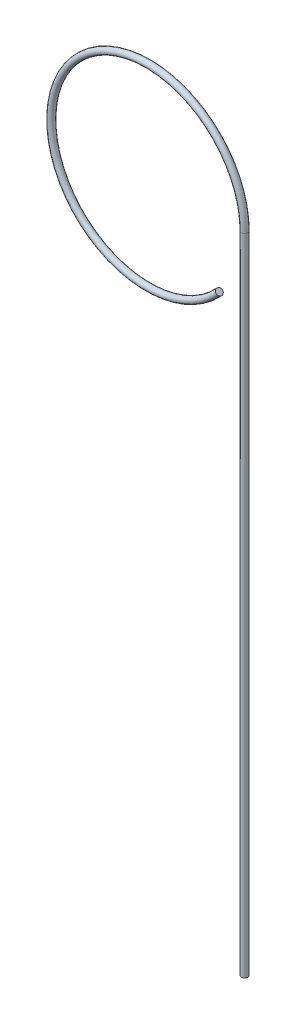
ISO-10303-21;
HEADER;
FILE_DESCRIPTION(('STEP AP214'),'2;1');
FILE_NAME('part.step','',(''),(''),'','','');
FILE_SCHEMA(('AUTOMOTIVE_DESIGN { 1 0 10303 214 1 1 1 1 }'));
ENDSEC;
DATA;
#1=APPLICATION_CONTEXT('core data for automotive mechanical design processes');
#2=APPLICATION_PROTOCOL_DEFINITION('international standard','automotive_design',2000,#1);
#3=PRODUCT_CONTEXT('',#1,'mechanical');
#4=PRODUCT('Part','Part','',(#3));
#5=PRODUCT_RELATED_PRODUCT_CATEGORY('part','',(#4));
#6=PRODUCT_DEFINITION_FORMATION('','',#4);
#7=PRODUCT_DEFINITION_CONTEXT('part definition',#1,'design');
#8=PRODUCT_DEFINITION('design','',#6,#7);
#9=PRODUCT_DEFINITION_SHAPE('','',#8);
#10=(LENGTH_UNIT() NAMED_UNIT(*) SI_UNIT(.MILLI.,.METRE.));
#11=(NAMED_UNIT(*) PLANE_ANGLE_UNIT() SI_UNIT($,.RADIAN.));
#12=(NAMED_UNIT(*) SI_UNIT($,.STERADIAN.) SOLID_ANGLE_UNIT());
#13=UNCERTAINTY_MEASURE_WITH_UNIT(LENGTH_MEASURE(1.E-05),#10,'distance_accuracy_value','');
#14=(GEOMETRIC_REPRESENTATION_CONTEXT(3) GLOBAL_UNCERTAINTY_ASSIGNED_CONTEXT((#13)) GLOBAL_UNIT_ASSIGNED_CONTEXT((#10,
#11,#12)) REPRESENTATION_CONTEXT('',''));
#15=CARTESIAN_POINT('',(0.,0.,0.));
#16=DIRECTION('',(0.,0.,1.));
#17=DIRECTION('',(1.,0.,0.));
#18=AXIS2_PLACEMENT_3D('',#15,#16,#17);
#19=CARTESIAN_POINT('',(22.1333046013693,-20.2513413734252,0.));
#20=DIRECTION('',(0.675044712447505,0.737776820045645,0.));
#21=DIRECTION('',(0.,0.,1.));
#22=AXIS2_PLACEMENT_3D('',#19,#20,#21);
#23=PLANE('',#22);
#24=CARTESIAN_POINT('',(22.1333046013693,-20.2513413734252,0.));
#25=DIRECTION('',(0.675044712447505,0.737776820045645,0.));
#26=DIRECTION('',(0.,0.,1.));
#27=AXIS2_PLACEMENT_3D('',#24,#25,#26);
#28=CIRCLE('',#27,1.);
#29=CARTESIAN_POINT('',(22.871081421415,-20.9263860858727,0.));
#30=VERTEX_POINT('',#29);
#31=EDGE_CURVE('E48',#30,#30,#28,.T.);
#32=ORIENTED_EDGE('',*,*,#31,.T.);
#33=EDGE_LOOP('',(#32));
#34=FACE_BOUND('',#33,.T.);
#35=ADVANCED_FACE('F41',(#34),#23,.T.);
#36=CARTESIAN_POINT('',(0.,0.,0.));
#37=DIRECTION('',(0.,0.,-1.));
#38=DIRECTION('',(-1.,0.,0.));
#39=AXIS2_PLACEMENT_3D('',#36,#37,#38);
#40=TOROIDAL_SURFACE('',#39,30.,1.);
#41=CARTESIAN_POINT('',(30.,0.,0.));
#42=DIRECTION('',(0.,1.,0.));
#43=DIRECTION('',(0.,0.,1.));
#44=AXIS2_PLACEMENT_3D('',#41,#42,#43);
#45=CIRCLE('',#44,1.);
#46=CARTESIAN_POINT('',(31.,0.,0.));
#47=VERTEX_POINT('',#46);
#48=EDGE_CURVE('E10',#47,#47,#45,.T.);
#49=CARTESIAN_POINT('',(0.,0.,0.));
#50=DIRECTION('',(0.,0.,-1.));
#51=DIRECTION('',(-1.,0.,0.));
#52=AXIS2_PLACEMENT_3D('',#49,#50,#51);
#53=CIRCLE('',#52,31.);
#54=EDGE_CURVE('',#30,#47,#53,.T.);
#55=ORIENTED_EDGE('',*,*,#31,.F.);
#56=ORIENTED_EDGE('',*,*,#48,.T.);
#57=ORIENTED_EDGE('',*,*,#54,.T.);
#58=ORIENTED_EDGE('',*,*,#54,.F.);
#59=EDGE_LOOP('',(#55,#57,#56,#58));
#60=FACE_BOUND('',#59,.T.);
#61=ADVANCED_FACE('F65',(#60),#40,.T.);
#62=CARTESIAN_POINT('',(30.,0.,0.));
#63=DIRECTION('',(0.,-1.,0.));
#64=DIRECTION('',(1.,0.,0.));
#65=AXIS2_PLACEMENT_3D('',#62,#63,#64);
#66=CYLINDRICAL_SURFACE('',#65,1.);
#67=ORIENTED_EDGE('',*,*,#48,.F.);
#68=EDGE_LOOP('',(#67));
#69=FACE_BOUND('',#68,.T.);
#70=CARTESIAN_POINT('',(30.,-200.,0.));
#71=DIRECTION('',(0.,-1.,0.));
#72=DIRECTION('',(0.,0.,-1.));
#73=AXIS2_PLACEMENT_3D('',#70,#71,#72);
#74=CIRCLE('',#73,1.);
#75=CARTESIAN_POINT('',(30.,-200.,-1.));
#76=VERTEX_POINT('',#75);
#77=EDGE_CURVE('E53',#76,#76,#74,.T.);
#78=ORIENTED_EDGE('',*,*,#77,.F.);
#79=EDGE_LOOP('',(#78));
#80=FACE_BOUND('',#79,.T.);
#81=ADVANCED_FACE('F63',(#69,#80),#66,.T.);
#82=CARTESIAN_POINT('',(30.,-200.,0.));
#83=DIRECTION('',(0.,-1.,0.));
#84=DIRECTION('',(0.,0.,-1.));
#85=AXIS2_PLACEMENT_3D('',#82,#83,#84);
#86=PLANE('',#85);
#87=ORIENTED_EDGE('',*,*,#77,.T.);
#88=EDGE_LOOP('',(#87));
#89=FACE_BOUND('',#88,.T.);
#90=ADVANCED_FACE('F61',(#89),#86,.T.);
#91=CLOSED_SHELL('',(#35,#61,#81,#90));
#92=MANIFOLD_SOLID_BREP('B2',#91);
#93=ADVANCED_BREP_SHAPE_REPRESENTATION('',(#18,#92),#14);
#94=SHAPE_DEFINITION_REPRESENTATION(#9,#93);
ENDSEC;
END-ISO-10303-21;
